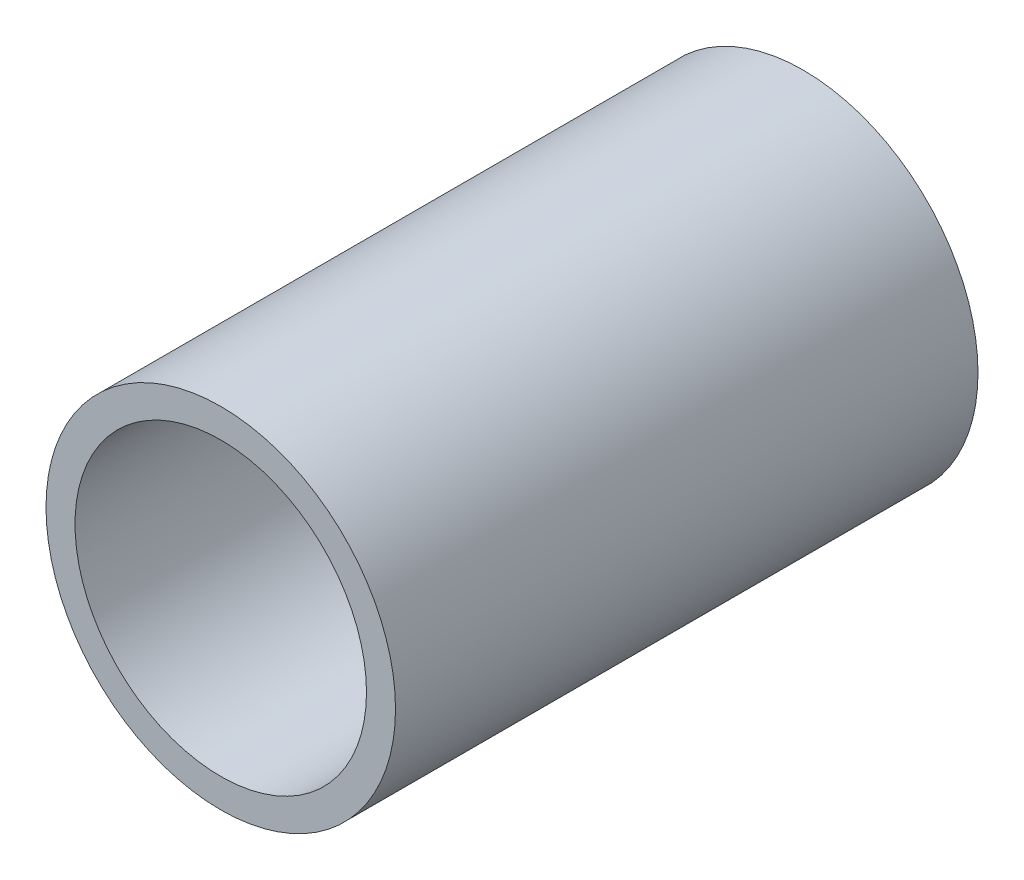
ISO-10303-21;
HEADER;
FILE_DESCRIPTION(('STEP AP214'),'2;1');
FILE_NAME('part.step','',(''),(''),'','','');
FILE_SCHEMA(('AUTOMOTIVE_DESIGN { 1 0 10303 214 1 1 1 1 }'));
ENDSEC;
DATA;
#1=APPLICATION_CONTEXT('core data for automotive mechanical design processes');
#2=APPLICATION_PROTOCOL_DEFINITION('international standard','automotive_design',2000,#1);
#3=PRODUCT_CONTEXT('',#1,'mechanical');
#4=PRODUCT('Part','Part','',(#3));
#5=PRODUCT_RELATED_PRODUCT_CATEGORY('part','',(#4));
#6=PRODUCT_DEFINITION_FORMATION('','',#4);
#7=PRODUCT_DEFINITION_CONTEXT('part definition',#1,'design');
#8=PRODUCT_DEFINITION('design','',#6,#7);
#9=PRODUCT_DEFINITION_SHAPE('','',#8);
#10=(LENGTH_UNIT() NAMED_UNIT(*) SI_UNIT(.MILLI.,.METRE.));
#11=(NAMED_UNIT(*) PLANE_ANGLE_UNIT() SI_UNIT($,.RADIAN.));
#12=(NAMED_UNIT(*) SI_UNIT($,.STERADIAN.) SOLID_ANGLE_UNIT());
#13=UNCERTAINTY_MEASURE_WITH_UNIT(LENGTH_MEASURE(1.E-05),#10,'distance_accuracy_value','');
#14=(GEOMETRIC_REPRESENTATION_CONTEXT(3) GLOBAL_UNCERTAINTY_ASSIGNED_CONTEXT((#13)) GLOBAL_UNIT_ASSIGNED_CONTEXT((#10,
#11,#12)) REPRESENTATION_CONTEXT('',''));
#15=CARTESIAN_POINT('',(0.,0.,0.));
#16=DIRECTION('',(0.,0.,1.));
#17=DIRECTION('',(1.,0.,0.));
#18=AXIS2_PLACEMENT_3D('',#15,#16,#17);
#19=CARTESIAN_POINT('',(0.,0.,31.75));
#20=DIRECTION('',(0.,0.,1.));
#21=DIRECTION('',(1.,0.,0.));
#22=AXIS2_PLACEMENT_3D('',#19,#20,#21);
#23=PLANE('',#22);
#24=CARTESIAN_POINT('',(0.,0.,31.75));
#25=DIRECTION('',(0.,0.,1.));
#26=DIRECTION('',(1.,0.,0.));
#27=AXIS2_PLACEMENT_3D('',#24,#25,#26);
#28=CIRCLE('',#27,19.05);
#29=CARTESIAN_POINT('',(19.05,0.,31.75));
#30=VERTEX_POINT('',#29);
#31=EDGE_CURVE('E10',#30,#30,#28,.T.);
#32=ORIENTED_EDGE('',*,*,#31,.T.);
#33=EDGE_LOOP('',(#32));
#34=FACE_BOUND('',#33,.T.);
#35=CARTESIAN_POINT('',(0.,0.,31.75));
#36=DIRECTION('',(0.,0.,1.));
#37=DIRECTION('',(1.,0.,0.));
#38=AXIS2_PLACEMENT_3D('',#35,#36,#37);
#39=CIRCLE('',#38,15.8877);
#40=CARTESIAN_POINT('',(15.8877,0.,31.75));
#41=VERTEX_POINT('',#40);
#42=EDGE_CURVE('E43',#41,#41,#39,.T.);
#43=ORIENTED_EDGE('',*,*,#42,.F.);
#44=EDGE_LOOP('',(#43));
#45=FACE_BOUND('',#44,.T.);
#46=ADVANCED_FACE('F32',(#34,#45),#23,.T.);
#47=CARTESIAN_POINT('',(0.,0.,-31.75));
#48=DIRECTION('',(0.,0.,1.));
#49=DIRECTION('',(1.,0.,0.));
#50=AXIS2_PLACEMENT_3D('',#47,#48,#49);
#51=PLANE('',#50);
#52=CARTESIAN_POINT('',(0.,0.,-31.75));
#53=DIRECTION('',(0.,0.,1.));
#54=DIRECTION('',(1.,0.,0.));
#55=AXIS2_PLACEMENT_3D('',#52,#53,#54);
#56=CIRCLE('',#55,19.05);
#57=CARTESIAN_POINT('',(19.05,0.,-31.75));
#58=VERTEX_POINT('',#57);
#59=EDGE_CURVE('E36',#58,#58,#56,.T.);
#60=ORIENTED_EDGE('',*,*,#59,.F.);
#61=EDGE_LOOP('',(#60));
#62=FACE_BOUND('',#61,.T.);
#63=CARTESIAN_POINT('',(0.,0.,-31.75));
#64=DIRECTION('',(0.,0.,1.));
#65=DIRECTION('',(1.,0.,0.));
#66=AXIS2_PLACEMENT_3D('',#63,#64,#65);
#67=CIRCLE('',#66,15.8877);
#68=CARTESIAN_POINT('',(15.8877,0.,-31.75));
#69=VERTEX_POINT('',#68);
#70=EDGE_CURVE('E45',#69,#69,#67,.T.);
#71=ORIENTED_EDGE('',*,*,#70,.T.);
#72=EDGE_LOOP('',(#71));
#73=FACE_BOUND('',#72,.T.);
#74=ADVANCED_FACE('F55',(#62,#73),#51,.F.);
#75=CARTESIAN_POINT('',(0.,0.,31.75));
#76=DIRECTION('',(0.,0.,-1.));
#77=DIRECTION('',(-1.,0.,0.));
#78=AXIS2_PLACEMENT_3D('',#75,#76,#77);
#79=CYLINDRICAL_SURFACE('',#78,19.05);
#80=ORIENTED_EDGE('',*,*,#31,.F.);
#81=EDGE_LOOP('',(#80));
#82=FACE_BOUND('',#81,.T.);
#83=ORIENTED_EDGE('',*,*,#59,.T.);
#84=EDGE_LOOP('',(#83));
#85=FACE_BOUND('',#84,.T.);
#86=ADVANCED_FACE('F34',(#82,#85),#79,.T.);
#87=CARTESIAN_POINT('',(0.,0.,31.75));
#88=DIRECTION('',(0.,0.,-1.));
#89=DIRECTION('',(-1.,0.,0.));
#90=AXIS2_PLACEMENT_3D('',#87,#88,#89);
#91=CYLINDRICAL_SURFACE('',#90,15.8877);
#92=ORIENTED_EDGE('',*,*,#42,.T.);
#93=EDGE_LOOP('',(#92));
#94=FACE_BOUND('',#93,.T.);
#95=ORIENTED_EDGE('',*,*,#70,.F.);
#96=EDGE_LOOP('',(#95));
#97=FACE_BOUND('',#96,.T.);
#98=ADVANCED_FACE('F51',(#94,#97),#91,.F.);
#99=CLOSED_SHELL('',(#46,#74,#86,#98));
#100=MANIFOLD_SOLID_BREP('B2',#99);
#101=ADVANCED_BREP_SHAPE_REPRESENTATION('',(#18,#100),#14);
#102=SHAPE_DEFINITION_REPRESENTATION(#9,#101);
ENDSEC;
END-ISO-10303-21;
